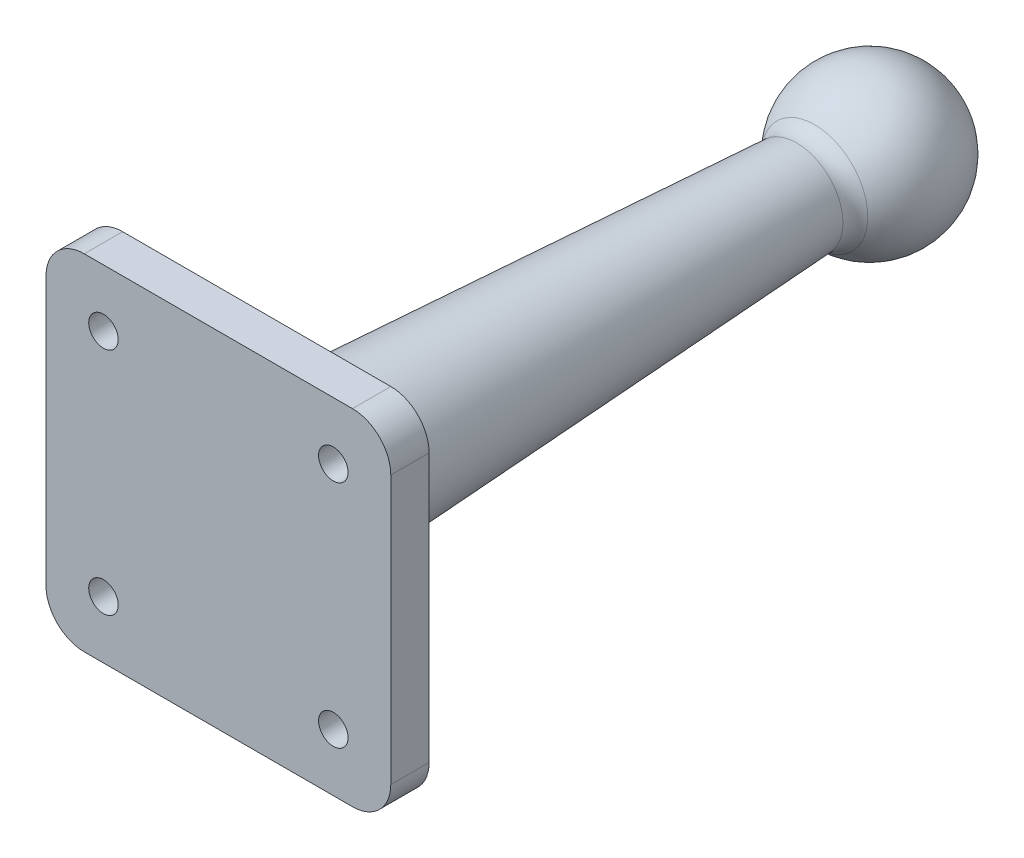
ISO-10303-21;
HEADER;
FILE_DESCRIPTION(('STEP AP214'),'2;1');
FILE_NAME('part.step','',(''),(''),'','','');
FILE_SCHEMA(('AUTOMOTIVE_DESIGN { 1 0 10303 214 1 1 1 1 }'));
ENDSEC;
DATA;
#1=APPLICATION_CONTEXT('core data for automotive mechanical design processes');
#2=APPLICATION_PROTOCOL_DEFINITION('international standard','automotive_design',2000,#1);
#3=PRODUCT_CONTEXT('',#1,'mechanical');
#4=PRODUCT('Part','Part','',(#3));
#5=PRODUCT_RELATED_PRODUCT_CATEGORY('part','',(#4));
#6=PRODUCT_DEFINITION_FORMATION('','',#4);
#7=PRODUCT_DEFINITION_CONTEXT('part definition',#1,'design');
#8=PRODUCT_DEFINITION('design','',#6,#7);
#9=PRODUCT_DEFINITION_SHAPE('','',#8);
#10=(LENGTH_UNIT() NAMED_UNIT(*) SI_UNIT(.MILLI.,.METRE.));
#11=(NAMED_UNIT(*) PLANE_ANGLE_UNIT() SI_UNIT($,.RADIAN.));
#12=(NAMED_UNIT(*) SI_UNIT($,.STERADIAN.) SOLID_ANGLE_UNIT());
#13=UNCERTAINTY_MEASURE_WITH_UNIT(LENGTH_MEASURE(1.E-05),#10,'distance_accuracy_value','');
#14=(GEOMETRIC_REPRESENTATION_CONTEXT(3) GLOBAL_UNCERTAINTY_ASSIGNED_CONTEXT((#13)) GLOBAL_UNIT_ASSIGNED_CONTEXT((#10,
#11,#12)) REPRESENTATION_CONTEXT('',''));
#15=CARTESIAN_POINT('',(0.,0.,0.));
#16=DIRECTION('',(0.,0.,1.));
#17=DIRECTION('',(1.,0.,0.));
#18=AXIS2_PLACEMENT_3D('',#15,#16,#17);
#19=CARTESIAN_POINT('',(0.,0.,0.));
#20=DIRECTION('',(0.,0.,1.));
#21=DIRECTION('',(1.,0.,0.));
#22=AXIS2_PLACEMENT_3D('',#19,#20,#21);
#23=CONICAL_SURFACE('',#22,10.,0.0561907862012373);
#24=CARTESIAN_POINT('',(0.,0.,-4.99210856556386));
#25=DIRECTION('',(0.,0.,1.));
#26=DIRECTION('',(1.,0.,0.));
#27=AXIS2_PLACEMENT_3D('',#24,#25,#26);
#28=CIRCLE('',#27,9.71919389318704);
#29=CARTESIAN_POINT('',(9.71919389318704,0.,-4.99210856556386));
#30=VERTEX_POINT('',#29);
#31=EDGE_CURVE('E11',#30,#30,#28,.F.);
#32=ORIENTED_EDGE('',*,*,#31,.T.);
#33=EDGE_LOOP('',(#32));
#34=FACE_BOUND('',#33,.T.);
#35=CARTESIAN_POINT('',(0.,0.,-70.4802828168123));
#36=DIRECTION('',(0.,0.,-1.));
#37=DIRECTION('',(-1.,0.,0.));
#38=AXIS2_PLACEMENT_3D('',#35,#36,#37);
#39=CIRCLE('',#38,6.0354840915543);
#40=CARTESIAN_POINT('',(-6.0354840915543,0.,-70.4802828168123));
#41=VERTEX_POINT('',#40);
#42=EDGE_CURVE('E196',#41,#41,#39,.F.);
#43=ORIENTED_EDGE('',*,*,#42,.T.);
#44=EDGE_LOOP('',(#43));
#45=FACE_BOUND('',#44,.T.);
#46=ADVANCED_FACE('F47',(#34,#45),#23,.T.);
#47=CARTESIAN_POINT('',(22.5,-22.5,5.));
#48=DIRECTION('',(-1.,0.,0.));
#49=DIRECTION('',(0.,0.,1.));
#50=AXIS2_PLACEMENT_3D('',#47,#48,#49);
#51=PLANE('',#50);
#52=DIRECTION('',(0.,1.,0.));
#53=VECTOR('',#52,1.);
#54=CARTESIAN_POINT('',(22.5,-22.5,0.));
#55=LINE('',#54,#53);
#56=CARTESIAN_POINT('',(22.5,-17.5,0.));
#57=VERTEX_POINT('',#56);
#58=CARTESIAN_POINT('',(22.5,17.5,0.));
#59=VERTEX_POINT('',#58);
#60=EDGE_CURVE('E270',#57,#59,#55,.T.);
#61=ORIENTED_EDGE('',*,*,#60,.T.);
#62=DIRECTION('',(0.,0.,-1.));
#63=VECTOR('',#62,1.);
#64=CARTESIAN_POINT('',(22.5,17.5,5.));
#65=LINE('',#64,#63);
#66=CARTESIAN_POINT('',(22.5,17.5,5.));
#67=VERTEX_POINT('',#66);
#68=EDGE_CURVE('E193',#59,#67,#65,.F.);
#69=ORIENTED_EDGE('',*,*,#68,.T.);
#70=DIRECTION('',(0.,1.,0.));
#71=VECTOR('',#70,1.);
#72=CARTESIAN_POINT('',(22.5,-22.5,5.));
#73=LINE('',#72,#71);
#74=CARTESIAN_POINT('',(22.5,-17.5,5.));
#75=VERTEX_POINT('',#74);
#76=EDGE_CURVE('E145',#75,#67,#73,.T.);
#77=ORIENTED_EDGE('',*,*,#76,.F.);
#78=DIRECTION('',(0.,0.,-1.));
#79=VECTOR('',#78,1.);
#80=CARTESIAN_POINT('',(22.5,-17.5,5.));
#81=LINE('',#80,#79);
#82=EDGE_CURVE('E189',#75,#57,#81,.T.);
#83=ORIENTED_EDGE('',*,*,#82,.T.);
#84=EDGE_LOOP('',(#61,#69,#77,#83));
#85=FACE_BOUND('',#84,.T.);
#86=ADVANCED_FACE('F220',(#85),#51,.F.);
#87=CARTESIAN_POINT('',(-22.5,22.5,5.));
#88=DIRECTION('',(0.,-1.,0.));
#89=DIRECTION('',(0.,0.,-1.));
#90=AXIS2_PLACEMENT_3D('',#87,#88,#89);
#91=PLANE('',#90);
#92=DIRECTION('',(-1.,0.,0.));
#93=VECTOR('',#92,1.);
#94=CARTESIAN_POINT('',(-22.5,22.5,0.));
#95=LINE('',#94,#93);
#96=CARTESIAN_POINT('',(17.5,22.5,0.));
#97=VERTEX_POINT('',#96);
#98=CARTESIAN_POINT('',(-17.5,22.5,0.));
#99=VERTEX_POINT('',#98);
#100=EDGE_CURVE('E154',#97,#99,#95,.T.);
#101=ORIENTED_EDGE('',*,*,#100,.T.);
#102=DIRECTION('',(0.,0.,-1.));
#103=VECTOR('',#102,1.);
#104=CARTESIAN_POINT('',(-17.5,22.5,5.));
#105=LINE('',#104,#103);
#106=CARTESIAN_POINT('',(-17.5,22.5,5.));
#107=VERTEX_POINT('',#106);
#108=EDGE_CURVE('E64',#99,#107,#105,.F.);
#109=ORIENTED_EDGE('',*,*,#108,.T.);
#110=DIRECTION('',(-1.,0.,0.));
#111=VECTOR('',#110,1.);
#112=CARTESIAN_POINT('',(-22.5,22.5,5.));
#113=LINE('',#112,#111);
#114=CARTESIAN_POINT('',(17.5,22.5,5.));
#115=VERTEX_POINT('',#114);
#116=EDGE_CURVE('E151',#115,#107,#113,.T.);
#117=ORIENTED_EDGE('',*,*,#116,.F.);
#118=DIRECTION('',(0.,0.,-1.));
#119=VECTOR('',#118,1.);
#120=CARTESIAN_POINT('',(17.5,22.5,5.));
#121=LINE('',#120,#119);
#122=EDGE_CURVE('E183',#115,#97,#121,.T.);
#123=ORIENTED_EDGE('',*,*,#122,.T.);
#124=EDGE_LOOP('',(#101,#109,#117,#123));
#125=FACE_BOUND('',#124,.T.);
#126=ADVANCED_FACE('F225',(#125),#91,.F.);
#127=CARTESIAN_POINT('',(-22.5,-22.5,5.));
#128=DIRECTION('',(1.,0.,0.));
#129=DIRECTION('',(0.,0.,-1.));
#130=AXIS2_PLACEMENT_3D('',#127,#128,#129);
#131=PLANE('',#130);
#132=DIRECTION('',(0.,-1.,0.));
#133=VECTOR('',#132,1.);
#134=CARTESIAN_POINT('',(-22.5,-22.5,0.));
#135=LINE('',#134,#133);
#136=CARTESIAN_POINT('',(-22.5,17.5,0.));
#137=VERTEX_POINT('',#136);
#138=CARTESIAN_POINT('',(-22.5,-17.5,0.));
#139=VERTEX_POINT('',#138);
#140=EDGE_CURVE('E146',#137,#139,#135,.T.);
#141=ORIENTED_EDGE('',*,*,#140,.T.);
#142=DIRECTION('',(0.,0.,-1.));
#143=VECTOR('',#142,1.);
#144=CARTESIAN_POINT('',(-22.5,-17.5,5.));
#145=LINE('',#144,#143);
#146=CARTESIAN_POINT('',(-22.5,-17.5,5.));
#147=VERTEX_POINT('',#146);
#148=EDGE_CURVE('E121',#139,#147,#145,.F.);
#149=ORIENTED_EDGE('',*,*,#148,.T.);
#150=DIRECTION('',(0.,-1.,0.));
#151=VECTOR('',#150,1.);
#152=CARTESIAN_POINT('',(-22.5,-22.5,5.));
#153=LINE('',#152,#151);
#154=CARTESIAN_POINT('',(-22.5,17.5,5.));
#155=VERTEX_POINT('',#154);
#156=EDGE_CURVE('E280',#155,#147,#153,.T.);
#157=ORIENTED_EDGE('',*,*,#156,.F.);
#158=DIRECTION('',(0.,0.,-1.));
#159=VECTOR('',#158,1.);
#160=CARTESIAN_POINT('',(-22.5,17.5,5.));
#161=LINE('',#160,#159);
#162=EDGE_CURVE('E127',#155,#137,#161,.T.);
#163=ORIENTED_EDGE('',*,*,#162,.T.);
#164=EDGE_LOOP('',(#141,#149,#157,#163));
#165=FACE_BOUND('',#164,.T.);
#166=ADVANCED_FACE('F241',(#165),#131,.F.);
#167=CARTESIAN_POINT('',(-22.5,-22.5,5.));
#168=DIRECTION('',(0.,1.,0.));
#169=DIRECTION('',(0.,0.,1.));
#170=AXIS2_PLACEMENT_3D('',#167,#168,#169);
#171=PLANE('',#170);
#172=DIRECTION('',(1.,0.,0.));
#173=VECTOR('',#172,1.);
#174=CARTESIAN_POINT('',(-22.5,-22.5,5.));
#175=LINE('',#174,#173);
#176=CARTESIAN_POINT('',(-17.5,-22.5,5.));
#177=VERTEX_POINT('',#176);
#178=CARTESIAN_POINT('',(17.5,-22.5,5.));
#179=VERTEX_POINT('',#178);
#180=EDGE_CURVE('E137',#177,#179,#175,.T.);
#181=ORIENTED_EDGE('',*,*,#180,.F.);
#182=DIRECTION('',(0.,0.,-1.));
#183=VECTOR('',#182,1.);
#184=CARTESIAN_POINT('',(-17.5,-22.5,5.));
#185=LINE('',#184,#183);
#186=CARTESIAN_POINT('',(-17.5,-22.5,0.));
#187=VERTEX_POINT('',#186);
#188=EDGE_CURVE('E120',#177,#187,#185,.T.);
#189=ORIENTED_EDGE('',*,*,#188,.T.);
#190=DIRECTION('',(1.,0.,0.));
#191=VECTOR('',#190,1.);
#192=CARTESIAN_POINT('',(-22.5,-22.5,0.));
#193=LINE('',#192,#191);
#194=CARTESIAN_POINT('',(17.5,-22.5,0.));
#195=VERTEX_POINT('',#194);
#196=EDGE_CURVE('E134',#187,#195,#193,.T.);
#197=ORIENTED_EDGE('',*,*,#196,.T.);
#198=DIRECTION('',(0.,0.,-1.));
#199=VECTOR('',#198,1.);
#200=CARTESIAN_POINT('',(17.5,-22.5,5.));
#201=LINE('',#200,#199);
#202=EDGE_CURVE('E140',#195,#179,#201,.F.);
#203=ORIENTED_EDGE('',*,*,#202,.T.);
#204=EDGE_LOOP('',(#181,#189,#197,#203));
#205=FACE_BOUND('',#204,.T.);
#206=ADVANCED_FACE('F133',(#205),#171,.F.);
#207=CARTESIAN_POINT('',(0.,0.,5.));
#208=DIRECTION('',(0.,0.,-1.));
#209=DIRECTION('',(-1.,0.,0.));
#210=AXIS2_PLACEMENT_3D('',#207,#208,#209);
#211=PLANE('',#210);
#212=CARTESIAN_POINT('',(15.,15.,5.));
#213=DIRECTION('',(0.,0.,-1.));
#214=DIRECTION('',(1.,0.,0.));
#215=AXIS2_PLACEMENT_3D('',#212,#213,#214);
#216=CIRCLE('',#215,1.925);
#217=CARTESIAN_POINT('',(16.925,15.,5.));
#218=VERTEX_POINT('',#217);
#219=EDGE_CURVE('E291',#218,#218,#216,.T.);
#220=ORIENTED_EDGE('',*,*,#219,.T.);
#221=EDGE_LOOP('',(#220));
#222=FACE_BOUND('',#221,.T.);
#223=CARTESIAN_POINT('',(15.,-15.,5.));
#224=DIRECTION('',(0.,0.,-1.));
#225=DIRECTION('',(-1.,0.,0.));
#226=AXIS2_PLACEMENT_3D('',#223,#224,#225);
#227=CIRCLE('',#226,1.925);
#228=CARTESIAN_POINT('',(13.075,-15.,5.));
#229=VERTEX_POINT('',#228);
#230=EDGE_CURVE('E299',#229,#229,#227,.T.);
#231=ORIENTED_EDGE('',*,*,#230,.T.);
#232=EDGE_LOOP('',(#231));
#233=FACE_BOUND('',#232,.T.);
#234=CARTESIAN_POINT('',(-15.,-15.,5.));
#235=DIRECTION('',(0.,0.,-1.));
#236=DIRECTION('',(1.,0.,0.));
#237=AXIS2_PLACEMENT_3D('',#234,#235,#236);
#238=CIRCLE('',#237,1.925);
#239=CARTESIAN_POINT('',(-13.075,-15.,5.));
#240=VERTEX_POINT('',#239);
#241=EDGE_CURVE('E306',#240,#240,#238,.T.);
#242=ORIENTED_EDGE('',*,*,#241,.T.);
#243=EDGE_LOOP('',(#242));
#244=FACE_BOUND('',#243,.T.);
#245=CARTESIAN_POINT('',(-15.,15.,5.));
#246=DIRECTION('',(0.,0.,-1.));
#247=DIRECTION('',(-1.,0.,0.));
#248=AXIS2_PLACEMENT_3D('',#245,#246,#247);
#249=CIRCLE('',#248,1.925);
#250=CARTESIAN_POINT('',(-16.925,15.,5.));
#251=VERTEX_POINT('',#250);
#252=EDGE_CURVE('E275',#251,#251,#249,.T.);
#253=ORIENTED_EDGE('',*,*,#252,.T.);
#254=EDGE_LOOP('',(#253));
#255=FACE_BOUND('',#254,.T.);
#256=ORIENTED_EDGE('',*,*,#156,.T.);
#257=CARTESIAN_POINT('',(-17.5,-17.5,5.));
#258=DIRECTION('',(0.,0.,-1.));
#259=DIRECTION('',(-1.,0.,0.));
#260=AXIS2_PLACEMENT_3D('',#257,#258,#259);
#261=CIRCLE('',#260,5.);
#262=EDGE_CURVE('E180',#147,#177,#261,.F.);
#263=ORIENTED_EDGE('',*,*,#262,.T.);
#264=ORIENTED_EDGE('',*,*,#180,.T.);
#265=CARTESIAN_POINT('',(17.5,-17.5,5.));
#266=DIRECTION('',(0.,0.,-1.));
#267=DIRECTION('',(-1.,0.,0.));
#268=AXIS2_PLACEMENT_3D('',#265,#266,#267);
#269=CIRCLE('',#268,5.);
#270=EDGE_CURVE('E172',#179,#75,#269,.F.);
#271=ORIENTED_EDGE('',*,*,#270,.T.);
#272=ORIENTED_EDGE('',*,*,#76,.T.);
#273=CARTESIAN_POINT('',(17.5,17.5,5.));
#274=DIRECTION('',(0.,0.,-1.));
#275=DIRECTION('',(-1.,0.,0.));
#276=AXIS2_PLACEMENT_3D('',#273,#274,#275);
#277=CIRCLE('',#276,5.);
#278=EDGE_CURVE('E71',#67,#115,#277,.F.);
#279=ORIENTED_EDGE('',*,*,#278,.T.);
#280=ORIENTED_EDGE('',*,*,#116,.T.);
#281=CARTESIAN_POINT('',(-17.5,17.5,5.));
#282=DIRECTION('',(0.,0.,-1.));
#283=DIRECTION('',(-1.,0.,0.));
#284=AXIS2_PLACEMENT_3D('',#281,#282,#283);
#285=CIRCLE('',#284,5.);
#286=EDGE_CURVE('E177',#107,#155,#285,.F.);
#287=ORIENTED_EDGE('',*,*,#286,.T.);
#288=EDGE_LOOP('',(#256,#263,#264,#271,#272,#279,#280,#287));
#289=FACE_BOUND('',#288,.T.);
#290=ADVANCED_FACE('F233',(#222,#233,#244,#255,#289),#211,.F.);
#291=CARTESIAN_POINT('',(0.,0.,0.));
#292=DIRECTION('',(0.,0.,-1.));
#293=DIRECTION('',(-1.,0.,0.));
#294=AXIS2_PLACEMENT_3D('',#291,#292,#293);
#295=PLANE('',#294);
#296=CARTESIAN_POINT('',(0.,0.,0.));
#297=DIRECTION('',(0.,0.,-1.));
#298=DIRECTION('',(-1.,0.,0.));
#299=AXIS2_PLACEMENT_3D('',#296,#297,#298);
#300=CIRCLE('',#299,15.3063882480235);
#301=CARTESIAN_POINT('',(-15.3063882480235,0.,0.));
#302=VERTEX_POINT('',#301);
#303=EDGE_CURVE('E57',#302,#302,#300,.F.);
#304=ORIENTED_EDGE('',*,*,#303,.T.);
#305=EDGE_LOOP('',(#304));
#306=FACE_BOUND('',#305,.T.);
#307=CARTESIAN_POINT('',(15.,15.,0.));
#308=DIRECTION('',(0.,0.,-1.));
#309=DIRECTION('',(1.,0.,0.));
#310=AXIS2_PLACEMENT_3D('',#307,#308,#309);
#311=CIRCLE('',#310,1.925);
#312=CARTESIAN_POINT('',(16.925,15.,0.));
#313=VERTEX_POINT('',#312);
#314=EDGE_CURVE('E295',#313,#313,#311,.T.);
#315=ORIENTED_EDGE('',*,*,#314,.F.);
#316=EDGE_LOOP('',(#315));
#317=FACE_BOUND('',#316,.T.);
#318=CARTESIAN_POINT('',(15.,-15.,0.));
#319=DIRECTION('',(0.,0.,-1.));
#320=DIRECTION('',(-1.,0.,0.));
#321=AXIS2_PLACEMENT_3D('',#318,#319,#320);
#322=CIRCLE('',#321,1.925);
#323=CARTESIAN_POINT('',(13.075,-15.,0.));
#324=VERTEX_POINT('',#323);
#325=EDGE_CURVE('E302',#324,#324,#322,.T.);
#326=ORIENTED_EDGE('',*,*,#325,.F.);
#327=EDGE_LOOP('',(#326));
#328=FACE_BOUND('',#327,.T.);
#329=CARTESIAN_POINT('',(-15.,-15.,0.));
#330=DIRECTION('',(0.,0.,-1.));
#331=DIRECTION('',(1.,0.,0.));
#332=AXIS2_PLACEMENT_3D('',#329,#330,#331);
#333=CIRCLE('',#332,1.925);
#334=CARTESIAN_POINT('',(-13.075,-15.,0.));
#335=VERTEX_POINT('',#334);
#336=EDGE_CURVE('E287',#335,#335,#333,.T.);
#337=ORIENTED_EDGE('',*,*,#336,.F.);
#338=EDGE_LOOP('',(#337));
#339=FACE_BOUND('',#338,.T.);
#340=CARTESIAN_POINT('',(-15.,15.,0.));
#341=DIRECTION('',(0.,0.,-1.));
#342=DIRECTION('',(-1.,0.,0.));
#343=AXIS2_PLACEMENT_3D('',#340,#341,#342);
#344=CIRCLE('',#343,1.925);
#345=CARTESIAN_POINT('',(-16.925,15.,0.));
#346=VERTEX_POINT('',#345);
#347=EDGE_CURVE('E283',#346,#346,#344,.T.);
#348=ORIENTED_EDGE('',*,*,#347,.F.);
#349=EDGE_LOOP('',(#348));
#350=FACE_BOUND('',#349,.T.);
#351=ORIENTED_EDGE('',*,*,#196,.F.);
#352=CARTESIAN_POINT('',(-17.5,-17.5,0.));
#353=DIRECTION('',(0.,0.,-1.));
#354=DIRECTION('',(-1.,0.,0.));
#355=AXIS2_PLACEMENT_3D('',#352,#353,#354);
#356=CIRCLE('',#355,5.);
#357=EDGE_CURVE('E116',#187,#139,#356,.T.);
#358=ORIENTED_EDGE('',*,*,#357,.T.);
#359=ORIENTED_EDGE('',*,*,#140,.F.);
#360=CARTESIAN_POINT('',(-17.5,17.5,0.));
#361=DIRECTION('',(0.,0.,-1.));
#362=DIRECTION('',(-1.,0.,0.));
#363=AXIS2_PLACEMENT_3D('',#360,#361,#362);
#364=CIRCLE('',#363,5.);
#365=EDGE_CURVE('E128',#137,#99,#364,.T.);
#366=ORIENTED_EDGE('',*,*,#365,.T.);
#367=ORIENTED_EDGE('',*,*,#100,.F.);
#368=CARTESIAN_POINT('',(17.5,17.5,0.));
#369=DIRECTION('',(0.,0.,-1.));
#370=DIRECTION('',(-1.,0.,0.));
#371=AXIS2_PLACEMENT_3D('',#368,#369,#370);
#372=CIRCLE('',#371,5.);
#373=EDGE_CURVE('E162',#97,#59,#372,.T.);
#374=ORIENTED_EDGE('',*,*,#373,.T.);
#375=ORIENTED_EDGE('',*,*,#60,.F.);
#376=CARTESIAN_POINT('',(17.5,-17.5,0.));
#377=DIRECTION('',(0.,0.,-1.));
#378=DIRECTION('',(-1.,0.,0.));
#379=AXIS2_PLACEMENT_3D('',#376,#377,#378);
#380=CIRCLE('',#379,5.);
#381=EDGE_CURVE('E139',#57,#195,#380,.T.);
#382=ORIENTED_EDGE('',*,*,#381,.T.);
#383=EDGE_LOOP('',(#351,#358,#359,#366,#367,#374,#375,#382));
#384=FACE_BOUND('',#383,.T.);
#385=ADVANCED_FACE('F142',(#306,#317,#328,#339,#350,#384),#295,.T.);
#386=CARTESIAN_POINT('',(-17.5,-17.5,5.));
#387=DIRECTION('',(0.,0.,-1.));
#388=DIRECTION('',(-1.,0.,0.));
#389=AXIS2_PLACEMENT_3D('',#386,#387,#388);
#390=CYLINDRICAL_SURFACE('',#389,5.);
#391=ORIENTED_EDGE('',*,*,#262,.F.);
#392=ORIENTED_EDGE('',*,*,#148,.F.);
#393=ORIENTED_EDGE('',*,*,#357,.F.);
#394=ORIENTED_EDGE('',*,*,#188,.F.);
#395=EDGE_LOOP('',(#391,#392,#393,#394));
#396=FACE_BOUND('',#395,.T.);
#397=ADVANCED_FACE('F119',(#396),#390,.T.);
#398=CARTESIAN_POINT('',(-17.5,17.5,5.));
#399=DIRECTION('',(0.,0.,-1.));
#400=DIRECTION('',(-1.,0.,0.));
#401=AXIS2_PLACEMENT_3D('',#398,#399,#400);
#402=CYLINDRICAL_SURFACE('',#401,5.);
#403=ORIENTED_EDGE('',*,*,#286,.F.);
#404=ORIENTED_EDGE('',*,*,#108,.F.);
#405=ORIENTED_EDGE('',*,*,#365,.F.);
#406=ORIENTED_EDGE('',*,*,#162,.F.);
#407=EDGE_LOOP('',(#403,#404,#405,#406));
#408=FACE_BOUND('',#407,.T.);
#409=ADVANCED_FACE('F249',(#408),#402,.T.);
#410=CARTESIAN_POINT('',(17.5,17.5,5.));
#411=DIRECTION('',(0.,0.,-1.));
#412=DIRECTION('',(-1.,0.,0.));
#413=AXIS2_PLACEMENT_3D('',#410,#411,#412);
#414=CYLINDRICAL_SURFACE('',#413,5.);
#415=ORIENTED_EDGE('',*,*,#278,.F.);
#416=ORIENTED_EDGE('',*,*,#68,.F.);
#417=ORIENTED_EDGE('',*,*,#373,.F.);
#418=ORIENTED_EDGE('',*,*,#122,.F.);
#419=EDGE_LOOP('',(#415,#416,#417,#418));
#420=FACE_BOUND('',#419,.T.);
#421=ADVANCED_FACE('F252',(#420),#414,.T.);
#422=CARTESIAN_POINT('',(17.5,-17.5,5.));
#423=DIRECTION('',(0.,0.,-1.));
#424=DIRECTION('',(-1.,0.,0.));
#425=AXIS2_PLACEMENT_3D('',#422,#423,#424);
#426=CYLINDRICAL_SURFACE('',#425,5.);
#427=ORIENTED_EDGE('',*,*,#270,.F.);
#428=ORIENTED_EDGE('',*,*,#202,.F.);
#429=ORIENTED_EDGE('',*,*,#381,.F.);
#430=ORIENTED_EDGE('',*,*,#82,.F.);
#431=EDGE_LOOP('',(#427,#428,#429,#430));
#432=FACE_BOUND('',#431,.T.);
#433=ADVANCED_FACE('F256',(#432),#426,.T.);
#434=CARTESIAN_POINT('',(0.,0.,-80.));
#435=DIRECTION('',(0.,0.,-1.));
#436=DIRECTION('',(1.,0.,0.));
#437=AXIS2_PLACEMENT_3D('',#434,#435,#436);
#438=SPHERICAL_SURFACE('',#437,9.99999999999999);
#439=CARTESIAN_POINT('',(0.,0.,-72.8067434468464));
#440=DIRECTION('',(0.,0.,-1.));
#441=DIRECTION('',(-1.,0.,0.));
#442=AXIS2_PLACEMENT_3D('',#439,#440,#441);
#443=CIRCLE('',#442,6.94673017760962);
#444=CARTESIAN_POINT('',(-6.94673017760962,0.,-72.8067434468464));
#445=VERTEX_POINT('',#444);
#446=EDGE_CURVE('E200',#445,#445,#443,.T.);
#447=ORIENTED_EDGE('',*,*,#446,.T.);
#448=EDGE_LOOP('',(#447));
#449=FACE_BOUND('',#448,.T.);
#450=ADVANCED_FACE('F231',(#449),#438,.T.);
#451=CARTESIAN_POINT('',(-15.,15.,5.));
#452=DIRECTION('',(0.,0.,-1.));
#453=DIRECTION('',(-1.,0.,0.));
#454=AXIS2_PLACEMENT_3D('',#451,#452,#453);
#455=CYLINDRICAL_SURFACE('',#454,1.925);
#456=ORIENTED_EDGE('',*,*,#252,.F.);
#457=EDGE_LOOP('',(#456));
#458=FACE_BOUND('',#457,.T.);
#459=ORIENTED_EDGE('',*,*,#347,.T.);
#460=EDGE_LOOP('',(#459));
#461=FACE_BOUND('',#460,.T.);
#462=ADVANCED_FACE('F262',(#458,#461),#455,.F.);
#463=CARTESIAN_POINT('',(-15.,-15.,5.));
#464=DIRECTION('',(0.,0.,-1.));
#465=DIRECTION('',(-1.,0.,0.));
#466=AXIS2_PLACEMENT_3D('',#463,#464,#465);
#467=CYLINDRICAL_SURFACE('',#466,1.925);
#468=ORIENTED_EDGE('',*,*,#241,.F.);
#469=EDGE_LOOP('',(#468));
#470=FACE_BOUND('',#469,.T.);
#471=ORIENTED_EDGE('',*,*,#336,.T.);
#472=EDGE_LOOP('',(#471));
#473=FACE_BOUND('',#472,.T.);
#474=ADVANCED_FACE('F313',(#470,#473),#467,.F.);
#475=CARTESIAN_POINT('',(15.,-15.,5.));
#476=DIRECTION('',(0.,0.,-1.));
#477=DIRECTION('',(-1.,0.,0.));
#478=AXIS2_PLACEMENT_3D('',#475,#476,#477);
#479=CYLINDRICAL_SURFACE('',#478,1.925);
#480=ORIENTED_EDGE('',*,*,#230,.F.);
#481=EDGE_LOOP('',(#480));
#482=FACE_BOUND('',#481,.T.);
#483=ORIENTED_EDGE('',*,*,#325,.T.);
#484=EDGE_LOOP('',(#483));
#485=FACE_BOUND('',#484,.T.);
#486=ADVANCED_FACE('F322',(#482,#485),#479,.F.);
#487=CARTESIAN_POINT('',(15.,15.,5.));
#488=DIRECTION('',(0.,0.,-1.));
#489=DIRECTION('',(-1.,0.,0.));
#490=AXIS2_PLACEMENT_3D('',#487,#488,#489);
#491=CYLINDRICAL_SURFACE('',#490,1.925);
#492=ORIENTED_EDGE('',*,*,#219,.F.);
#493=EDGE_LOOP('',(#492));
#494=FACE_BOUND('',#493,.T.);
#495=ORIENTED_EDGE('',*,*,#314,.T.);
#496=EDGE_LOOP('',(#495));
#497=FACE_BOUND('',#496,.T.);
#498=ADVANCED_FACE('F216',(#494,#497),#491,.F.);
#499=CARTESIAN_POINT('',(0.,0.,-70.6487664809001));
#500=DIRECTION('',(0.,0.,-1.));
#501=DIRECTION('',(-1.,0.,0.));
#502=AXIS2_PLACEMENT_3D('',#499,#500,#501);
#503=TOROIDAL_SURFACE('',#502,9.03074923089264,3.);
#504=ORIENTED_EDGE('',*,*,#446,.F.);
#505=EDGE_LOOP('',(#504));
#506=FACE_BOUND('',#505,.T.);
#507=ORIENTED_EDGE('',*,*,#42,.F.);
#508=EDGE_LOOP('',(#507));
#509=FACE_BOUND('',#508,.T.);
#510=ADVANCED_FACE('F212',(#506,#509),#503,.F.);
#511=CARTESIAN_POINT('',(0.,0.,0.));
#512=DIRECTION('',(0.,0.,1.));
#513=DIRECTION('',(1.,0.,0.));
#514=AXIS2_PLACEMENT_3D('',#511,#512,#513);
#515=CONICAL_SURFACE('',#514,15.3063882480235,0.841588949598693);
#516=ORIENTED_EDGE('',*,*,#31,.F.);
#517=EDGE_LOOP('',(#516));
#518=FACE_BOUND('',#517,.T.);
#519=ORIENTED_EDGE('',*,*,#303,.F.);
#520=EDGE_LOOP('',(#519));
#521=FACE_BOUND('',#520,.T.);
#522=ADVANCED_FACE('F50',(#518,#521),#515,.T.);
#523=CLOSED_SHELL('',(#46,#86,#126,#166,#206,#290,#385,#397,#409,#421,#433,#450,#462,#474,#486,
#498,#510,#522));
#524=MANIFOLD_SOLID_BREP('B2',#523);
#525=ADVANCED_BREP_SHAPE_REPRESENTATION('',(#18,#524),#14);
#526=SHAPE_DEFINITION_REPRESENTATION(#9,#525);
ENDSEC;
END-ISO-10303-21;
